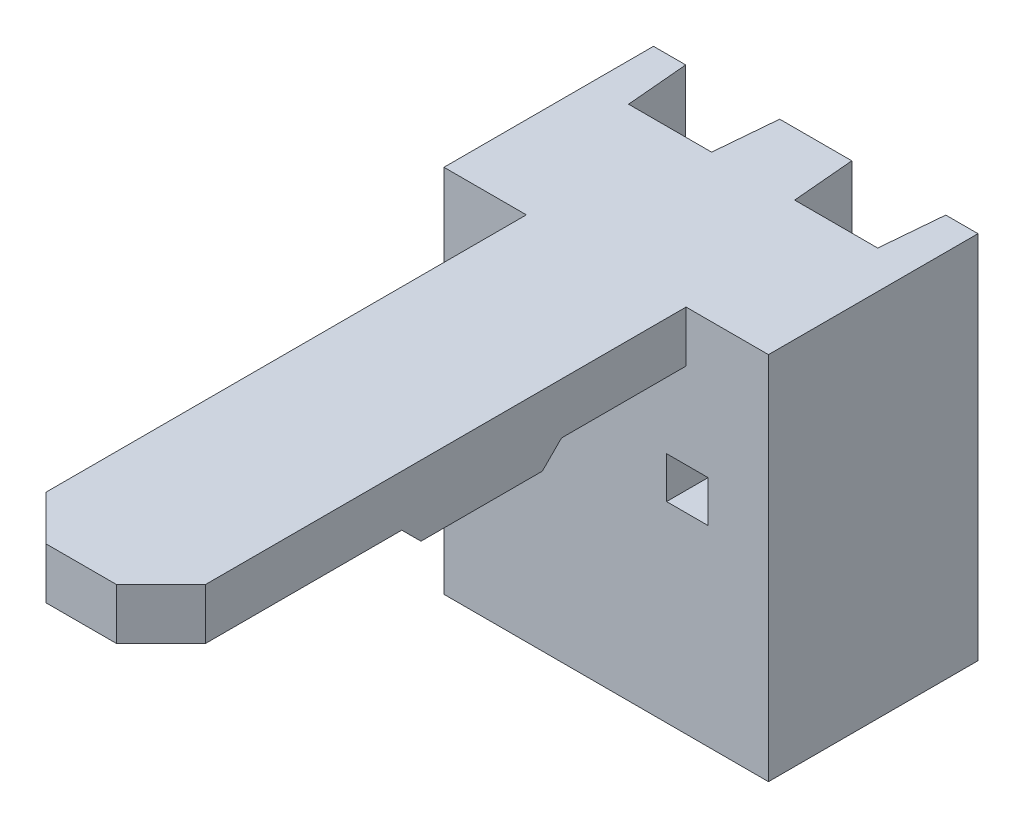
ISO-10303-21;
HEADER;
FILE_DESCRIPTION(('STEP AP214'),'2;1');
FILE_NAME('part.step','',(''),(''),'','','');
FILE_SCHEMA(('AUTOMOTIVE_DESIGN { 1 0 10303 214 1 1 1 1 }'));
ENDSEC;
DATA;
#1=APPLICATION_CONTEXT('core data for automotive mechanical design processes');
#2=APPLICATION_PROTOCOL_DEFINITION('international standard','automotive_design',2000,#1);
#3=PRODUCT_CONTEXT('',#1,'mechanical');
#4=PRODUCT('Part','Part','',(#3));
#5=PRODUCT_RELATED_PRODUCT_CATEGORY('part','',(#4));
#6=PRODUCT_DEFINITION_FORMATION('','',#4);
#7=PRODUCT_DEFINITION_CONTEXT('part definition',#1,'design');
#8=PRODUCT_DEFINITION('design','',#6,#7);
#9=PRODUCT_DEFINITION_SHAPE('','',#8);
#10=(LENGTH_UNIT() NAMED_UNIT(*) SI_UNIT(.MILLI.,.METRE.));
#11=(NAMED_UNIT(*) PLANE_ANGLE_UNIT() SI_UNIT($,.RADIAN.));
#12=(NAMED_UNIT(*) SI_UNIT($,.STERADIAN.) SOLID_ANGLE_UNIT());
#13=UNCERTAINTY_MEASURE_WITH_UNIT(LENGTH_MEASURE(1.E-05),#10,'distance_accuracy_value','');
#14=(GEOMETRIC_REPRESENTATION_CONTEXT(3) GLOBAL_UNCERTAINTY_ASSIGNED_CONTEXT((#13)) GLOBAL_UNIT_ASSIGNED_CONTEXT((#10,
#11,#12)) REPRESENTATION_CONTEXT('',''));
#15=CARTESIAN_POINT('',(0.,0.,0.));
#16=DIRECTION('',(0.,0.,1.));
#17=DIRECTION('',(1.,0.,0.));
#18=AXIS2_PLACEMENT_3D('',#15,#16,#17);
#19=CARTESIAN_POINT('',(0.,0.,-3.28));
#20=DIRECTION('',(0.,0.,1.));
#21=DIRECTION('',(1.,0.,0.));
#22=AXIS2_PLACEMENT_3D('',#19,#20,#21);
#23=PLANE('',#22);
#24=DIRECTION('',(1.,0.,0.));
#25=VECTOR('',#24,1.);
#26=CARTESIAN_POINT('',(0.,-2.895,-3.28));
#27=LINE('',#26,#25);
#28=CARTESIAN_POINT('',(-0.564261109744597,-2.895,-3.28));
#29=VERTEX_POINT('',#28);
#30=CARTESIAN_POINT('',(0.564261109744597,-2.895,-3.28));
#31=VERTEX_POINT('',#30);
#32=EDGE_CURVE('E225',#29,#31,#27,.T.);
#33=ORIENTED_EDGE('',*,*,#32,.F.);
#34=DIRECTION('',(0.,1.,0.));
#35=VECTOR('',#34,1.);
#36=CARTESIAN_POINT('',(-0.564261109744589,3.061095129369,-3.28));
#37=LINE('',#36,#35);
#38=CARTESIAN_POINT('',(-0.564261109744597,2.895,-3.28));
#39=VERTEX_POINT('',#38);
#40=EDGE_CURVE('E227',#29,#39,#37,.T.);
#41=ORIENTED_EDGE('',*,*,#40,.T.);
#42=DIRECTION('',(1.,0.,0.));
#43=VECTOR('',#42,1.);
#44=CARTESIAN_POINT('',(0.,2.895,-3.28));
#45=LINE('',#44,#43);
#46=CARTESIAN_POINT('',(0.564261109744597,2.895,-3.28));
#47=VERTEX_POINT('',#46);
#48=EDGE_CURVE('E20',#47,#39,#45,.F.);
#49=ORIENTED_EDGE('',*,*,#48,.F.);
#50=DIRECTION('',(0.,1.,0.));
#51=VECTOR('',#50,1.);
#52=CARTESIAN_POINT('',(0.564261109744589,3.061095129369,-3.28));
#53=LINE('',#52,#51);
#54=EDGE_CURVE('E246',#47,#31,#53,.F.);
#55=ORIENTED_EDGE('',*,*,#54,.T.);
#56=EDGE_LOOP('',(#33,#41,#49,#55));
#57=FACE_BOUND('',#56,.T.);
#58=ADVANCED_FACE('F17',(#57),#23,.F.);
#59=CARTESIAN_POINT('',(-0.65,3.061095129369,-2.3));
#60=DIRECTION('',(0.996194698091745,0.,0.087155742747664));
#61=DIRECTION('',(0.087155742747664,0.,-0.996194698091745));
#62=AXIS2_PLACEMENT_3D('',#59,#60,#61);
#63=PLANE('',#62);
#64=DIRECTION('',(0.087155742747664,0.,-0.996194698091745));
#65=VECTOR('',#64,1.);
#66=CARTESIAN_POINT('',(-0.65,-2.895,-2.3));
#67=LINE('',#66,#65);
#68=CARTESIAN_POINT('',(-0.65,-2.895,-2.3));
#69=VERTEX_POINT('',#68);
#70=EDGE_CURVE('E210',#69,#29,#67,.T.);
#71=ORIENTED_EDGE('',*,*,#70,.F.);
#72=DIRECTION('',(0.,1.,0.));
#73=VECTOR('',#72,1.);
#74=CARTESIAN_POINT('',(-0.65,-2.895,-2.3));
#75=LINE('',#74,#73);
#76=CARTESIAN_POINT('',(-0.65,2.895,-2.3));
#77=VERTEX_POINT('',#76);
#78=EDGE_CURVE('E233',#69,#77,#75,.T.);
#79=ORIENTED_EDGE('',*,*,#78,.T.);
#80=DIRECTION('',(0.087155742747664,0.,-0.996194698091745));
#81=VECTOR('',#80,1.);
#82=CARTESIAN_POINT('',(-0.65,2.895,-2.3));
#83=LINE('',#82,#81);
#84=EDGE_CURVE('E218',#39,#77,#83,.F.);
#85=ORIENTED_EDGE('',*,*,#84,.F.);
#86=ORIENTED_EDGE('',*,*,#40,.F.);
#87=EDGE_LOOP('',(#71,#79,#85,#86));
#88=FACE_BOUND('',#87,.T.);
#89=ADVANCED_FACE('F231',(#88),#63,.F.);
#90=CARTESIAN_POINT('',(-1.595,0.755,0.));
#91=DIRECTION('',(-1.,0.,0.));
#92=DIRECTION('',(0.,0.,1.));
#93=AXIS2_PLACEMENT_3D('',#90,#91,#92);
#94=PLANE('',#93);
#95=DIRECTION('',(0.,0.,-1.));
#96=VECTOR('',#95,1.);
#97=CARTESIAN_POINT('',(-1.595,0.105,0.));
#98=LINE('',#97,#96);
#99=CARTESIAN_POINT('',(-1.595,0.105,0.));
#100=VERTEX_POINT('',#99);
#101=CARTESIAN_POINT('',(-1.595,0.105,-2.3));
#102=VERTEX_POINT('',#101);
#103=EDGE_CURVE('E248',#100,#102,#98,.T.);
#104=ORIENTED_EDGE('',*,*,#103,.T.);
#105=DIRECTION('',(0.,1.,0.));
#106=VECTOR('',#105,1.);
#107=CARTESIAN_POINT('',(-1.595,-2.895,-2.3));
#108=LINE('',#107,#106);
#109=CARTESIAN_POINT('',(-1.595,0.755,-2.3));
#110=VERTEX_POINT('',#109);
#111=EDGE_CURVE('E258',#102,#110,#108,.T.);
#112=ORIENTED_EDGE('',*,*,#111,.T.);
#113=DIRECTION('',(0.,0.,1.));
#114=VECTOR('',#113,1.);
#115=CARTESIAN_POINT('',(-1.595,0.755,0.));
#116=LINE('',#115,#114);
#117=CARTESIAN_POINT('',(-1.595,0.755,0.));
#118=VERTEX_POINT('',#117);
#119=EDGE_CURVE('E266',#110,#118,#116,.T.);
#120=ORIENTED_EDGE('',*,*,#119,.T.);
#121=DIRECTION('',(0.,1.,0.));
#122=VECTOR('',#121,1.);
#123=CARTESIAN_POINT('',(-1.595,0.755,0.));
#124=LINE('',#123,#122);
#125=EDGE_CURVE('E229',#100,#118,#124,.T.);
#126=ORIENTED_EDGE('',*,*,#125,.F.);
#127=EDGE_LOOP('',(#104,#112,#120,#126));
#128=FACE_BOUND('',#127,.T.);
#129=ADVANCED_FACE('F490',(#128),#94,.F.);
#130=CARTESIAN_POINT('',(0.945,0.755,0.));
#131=DIRECTION('',(-1.,0.,0.));
#132=DIRECTION('',(0.,0.,1.));
#133=AXIS2_PLACEMENT_3D('',#130,#131,#132);
#134=PLANE('',#133);
#135=DIRECTION('',(0.,0.,-1.));
#136=VECTOR('',#135,1.);
#137=CARTESIAN_POINT('',(0.945,0.105,0.));
#138=LINE('',#137,#136);
#139=CARTESIAN_POINT('',(0.945,0.105,0.));
#140=VERTEX_POINT('',#139);
#141=CARTESIAN_POINT('',(0.945,0.105,-2.3));
#142=VERTEX_POINT('',#141);
#143=EDGE_CURVE('E271',#140,#142,#138,.T.);
#144=ORIENTED_EDGE('',*,*,#143,.T.);
#145=DIRECTION('',(0.,1.,0.));
#146=VECTOR('',#145,1.);
#147=CARTESIAN_POINT('',(0.945,0.755,-2.3));
#148=LINE('',#147,#146);
#149=CARTESIAN_POINT('',(0.945,0.755,-2.3));
#150=VERTEX_POINT('',#149);
#151=EDGE_CURVE('E239',#150,#142,#148,.F.);
#152=ORIENTED_EDGE('',*,*,#151,.F.);
#153=DIRECTION('',(0.,0.,1.));
#154=VECTOR('',#153,1.);
#155=CARTESIAN_POINT('',(0.945,0.755,0.));
#156=LINE('',#155,#154);
#157=CARTESIAN_POINT('',(0.945,0.755,0.));
#158=VERTEX_POINT('',#157);
#159=EDGE_CURVE('E277',#150,#158,#156,.T.);
#160=ORIENTED_EDGE('',*,*,#159,.T.);
#161=DIRECTION('',(0.,1.,0.));
#162=VECTOR('',#161,1.);
#163=CARTESIAN_POINT('',(0.945,0.755,0.));
#164=LINE('',#163,#162);
#165=EDGE_CURVE('E241',#140,#158,#164,.T.);
#166=ORIENTED_EDGE('',*,*,#165,.F.);
#167=EDGE_LOOP('',(#144,#152,#160,#166));
#168=FACE_BOUND('',#167,.T.);
#169=ADVANCED_FACE('F480',(#168),#134,.F.);
#170=CARTESIAN_POINT('',(0.65,3.061095129369,-2.3));
#171=DIRECTION('',(-0.996194698091745,0.,0.087155742747664));
#172=DIRECTION('',(0.087155742747664,0.,0.996194698091745));
#173=AXIS2_PLACEMENT_3D('',#170,#171,#172);
#174=PLANE('',#173);
#175=DIRECTION('',(0.087155742747664,0.,0.996194698091745));
#176=VECTOR('',#175,1.);
#177=CARTESIAN_POINT('',(0.65,2.895,-2.3));
#178=LINE('',#177,#176);
#179=CARTESIAN_POINT('',(0.65,2.895,-2.3));
#180=VERTEX_POINT('',#179);
#181=EDGE_CURVE('E221',#180,#47,#178,.F.);
#182=ORIENTED_EDGE('',*,*,#181,.F.);
#183=DIRECTION('',(0.,1.,0.));
#184=VECTOR('',#183,1.);
#185=CARTESIAN_POINT('',(0.65,-2.895,-2.3));
#186=LINE('',#185,#184);
#187=CARTESIAN_POINT('',(0.65,-2.895,-2.3));
#188=VERTEX_POINT('',#187);
#189=EDGE_CURVE('E284',#180,#188,#186,.F.);
#190=ORIENTED_EDGE('',*,*,#189,.T.);
#191=DIRECTION('',(0.087155742747664,0.,0.996194698091745));
#192=VECTOR('',#191,1.);
#193=CARTESIAN_POINT('',(0.65,-2.895,-2.3));
#194=LINE('',#193,#192);
#195=EDGE_CURVE('E243',#31,#188,#194,.T.);
#196=ORIENTED_EDGE('',*,*,#195,.F.);
#197=ORIENTED_EDGE('',*,*,#54,.F.);
#198=EDGE_LOOP('',(#182,#190,#196,#197));
#199=FACE_BOUND('',#198,.T.);
#200=ADVANCED_FACE('F477',(#199),#174,.F.);
#201=CARTESIAN_POINT('',(-1.595,0.105,0.));
#202=DIRECTION('',(0.,-1.,0.));
#203=DIRECTION('',(0.,0.,-1.));
#204=AXIS2_PLACEMENT_3D('',#201,#202,#203);
#205=PLANE('',#204);
#206=DIRECTION('',(0.,0.,-1.));
#207=VECTOR('',#206,1.);
#208=CARTESIAN_POINT('',(-0.945,0.105,0.));
#209=LINE('',#208,#207);
#210=CARTESIAN_POINT('',(-0.945,0.105,0.));
#211=VERTEX_POINT('',#210);
#212=CARTESIAN_POINT('',(-0.945,0.105,-2.3));
#213=VERTEX_POINT('',#212);
#214=EDGE_CURVE('E309',#211,#213,#209,.T.);
#215=ORIENTED_EDGE('',*,*,#214,.T.);
#216=DIRECTION('',(1.,0.,0.));
#217=VECTOR('',#216,1.);
#218=CARTESIAN_POINT('',(-0.65,0.105,-2.3));
#219=LINE('',#218,#217);
#220=EDGE_CURVE('E260',#213,#102,#219,.F.);
#221=ORIENTED_EDGE('',*,*,#220,.T.);
#222=ORIENTED_EDGE('',*,*,#103,.F.);
#223=DIRECTION('',(1.,0.,0.));
#224=VECTOR('',#223,1.);
#225=CARTESIAN_POINT('',(-1.595,0.105,0.));
#226=LINE('',#225,#224);
#227=EDGE_CURVE('E250',#211,#100,#226,.F.);
#228=ORIENTED_EDGE('',*,*,#227,.F.);
#229=EDGE_LOOP('',(#215,#221,#222,#228));
#230=FACE_BOUND('',#229,.T.);
#231=ADVANCED_FACE('F479',(#230),#205,.F.);
#232=CARTESIAN_POINT('',(-0.65,-2.895,-2.3));
#233=DIRECTION('',(0.,0.,1.));
#234=DIRECTION('',(1.,0.,0.));
#235=AXIS2_PLACEMENT_3D('',#232,#233,#234);
#236=PLANE('',#235);
#237=DIRECTION('',(0.,1.,0.));
#238=VECTOR('',#237,1.);
#239=CARTESIAN_POINT('',(-0.945,0.105,-2.3));
#240=LINE('',#239,#238);
#241=CARTESIAN_POINT('',(-0.945,0.755,-2.3));
#242=VERTEX_POINT('',#241);
#243=EDGE_CURVE('E311',#213,#242,#240,.T.);
#244=ORIENTED_EDGE('',*,*,#243,.T.);
#245=DIRECTION('',(1.,0.,0.));
#246=VECTOR('',#245,1.);
#247=CARTESIAN_POINT('',(-0.945,0.755,-2.3));
#248=LINE('',#247,#246);
#249=EDGE_CURVE('E263',#242,#110,#248,.F.);
#250=ORIENTED_EDGE('',*,*,#249,.T.);
#251=ORIENTED_EDGE('',*,*,#111,.F.);
#252=ORIENTED_EDGE('',*,*,#220,.F.);
#253=EDGE_LOOP('',(#244,#250,#251,#252));
#254=FACE_BOUND('',#253,.T.);
#255=DIRECTION('',(0.,1.,0.));
#256=VECTOR('',#255,1.);
#257=CARTESIAN_POINT('',(-1.95,3.061095129369,-2.3));
#258=LINE('',#257,#256);
#259=CARTESIAN_POINT('',(-1.95,-2.895,-2.3));
#260=VERTEX_POINT('',#259);
#261=CARTESIAN_POINT('',(-1.95,2.895,-2.3));
#262=VERTEX_POINT('',#261);
#263=EDGE_CURVE('E296',#260,#262,#258,.T.);
#264=ORIENTED_EDGE('',*,*,#263,.T.);
#265=DIRECTION('',(1.,0.,0.));
#266=VECTOR('',#265,1.);
#267=CARTESIAN_POINT('',(-0.65,2.895,-2.3));
#268=LINE('',#267,#266);
#269=EDGE_CURVE('E254',#77,#262,#268,.F.);
#270=ORIENTED_EDGE('',*,*,#269,.F.);
#271=ORIENTED_EDGE('',*,*,#78,.F.);
#272=DIRECTION('',(1.,0.,0.));
#273=VECTOR('',#272,1.);
#274=CARTESIAN_POINT('',(-0.65,-2.895,-2.3));
#275=LINE('',#274,#273);
#276=EDGE_CURVE('E256',#260,#69,#275,.T.);
#277=ORIENTED_EDGE('',*,*,#276,.F.);
#278=EDGE_LOOP('',(#264,#270,#271,#277));
#279=FACE_BOUND('',#278,.T.);
#280=ADVANCED_FACE('F487',(#254,#279),#236,.F.);
#281=CARTESIAN_POINT('',(-0.945,0.755,0.));
#282=DIRECTION('',(0.,1.,0.));
#283=DIRECTION('',(0.,0.,1.));
#284=AXIS2_PLACEMENT_3D('',#281,#282,#283);
#285=PLANE('',#284);
#286=ORIENTED_EDGE('',*,*,#119,.F.);
#287=ORIENTED_EDGE('',*,*,#249,.F.);
#288=DIRECTION('',(0.,0.,-1.));
#289=VECTOR('',#288,1.);
#290=CARTESIAN_POINT('',(-0.945,0.755,0.));
#291=LINE('',#290,#289);
#292=CARTESIAN_POINT('',(-0.945,0.755,0.));
#293=VERTEX_POINT('',#292);
#294=EDGE_CURVE('E313',#242,#293,#291,.F.);
#295=ORIENTED_EDGE('',*,*,#294,.T.);
#296=DIRECTION('',(1.,0.,0.));
#297=VECTOR('',#296,1.);
#298=CARTESIAN_POINT('',(-0.945,0.755,0.));
#299=LINE('',#298,#297);
#300=EDGE_CURVE('E269',#118,#293,#299,.T.);
#301=ORIENTED_EDGE('',*,*,#300,.F.);
#302=EDGE_LOOP('',(#286,#287,#295,#301));
#303=FACE_BOUND('',#302,.T.);
#304=ADVANCED_FACE('F577',(#303),#285,.F.);
#305=CARTESIAN_POINT('',(0.945,0.105,0.));
#306=DIRECTION('',(0.,-1.,0.));
#307=DIRECTION('',(0.,0.,-1.));
#308=AXIS2_PLACEMENT_3D('',#305,#306,#307);
#309=PLANE('',#308);
#310=DIRECTION('',(0.,0.,-1.));
#311=VECTOR('',#310,1.);
#312=CARTESIAN_POINT('',(1.595,0.105,0.));
#313=LINE('',#312,#311);
#314=CARTESIAN_POINT('',(1.595,0.105,0.));
#315=VERTEX_POINT('',#314);
#316=CARTESIAN_POINT('',(1.595,0.105,-2.3));
#317=VERTEX_POINT('',#316);
#318=EDGE_CURVE('E316',#315,#317,#313,.T.);
#319=ORIENTED_EDGE('',*,*,#318,.T.);
#320=DIRECTION('',(1.,0.,0.));
#321=VECTOR('',#320,1.);
#322=CARTESIAN_POINT('',(1.95,0.105,-2.3));
#323=LINE('',#322,#321);
#324=EDGE_CURVE('E291',#317,#142,#323,.F.);
#325=ORIENTED_EDGE('',*,*,#324,.T.);
#326=ORIENTED_EDGE('',*,*,#143,.F.);
#327=DIRECTION('',(1.,0.,0.));
#328=VECTOR('',#327,1.);
#329=CARTESIAN_POINT('',(0.945,0.105,0.));
#330=LINE('',#329,#328);
#331=EDGE_CURVE('E274',#315,#140,#330,.F.);
#332=ORIENTED_EDGE('',*,*,#331,.F.);
#333=EDGE_LOOP('',(#319,#325,#326,#332));
#334=FACE_BOUND('',#333,.T.);
#335=ADVANCED_FACE('F573',(#334),#309,.F.);
#336=CARTESIAN_POINT('',(1.595,0.755,0.));
#337=DIRECTION('',(0.,1.,0.));
#338=DIRECTION('',(0.,0.,1.));
#339=AXIS2_PLACEMENT_3D('',#336,#337,#338);
#340=PLANE('',#339);
#341=ORIENTED_EDGE('',*,*,#159,.F.);
#342=DIRECTION('',(1.,0.,0.));
#343=VECTOR('',#342,1.);
#344=CARTESIAN_POINT('',(1.95,0.755,-2.3));
#345=LINE('',#344,#343);
#346=CARTESIAN_POINT('',(1.595,0.755,-2.3));
#347=VERTEX_POINT('',#346);
#348=EDGE_CURVE('E289',#150,#347,#345,.T.);
#349=ORIENTED_EDGE('',*,*,#348,.T.);
#350=DIRECTION('',(0.,0.,-1.));
#351=VECTOR('',#350,1.);
#352=CARTESIAN_POINT('',(1.595,0.755,0.));
#353=LINE('',#352,#351);
#354=CARTESIAN_POINT('',(1.595,0.755,0.));
#355=VERTEX_POINT('',#354);
#356=EDGE_CURVE('E321',#347,#355,#353,.F.);
#357=ORIENTED_EDGE('',*,*,#356,.T.);
#358=DIRECTION('',(1.,0.,0.));
#359=VECTOR('',#358,1.);
#360=CARTESIAN_POINT('',(1.595,0.755,0.));
#361=LINE('',#360,#359);
#362=EDGE_CURVE('E280',#158,#355,#361,.T.);
#363=ORIENTED_EDGE('',*,*,#362,.F.);
#364=EDGE_LOOP('',(#341,#349,#357,#363));
#365=FACE_BOUND('',#364,.T.);
#366=ADVANCED_FACE('F569',(#365),#340,.F.);
#367=CARTESIAN_POINT('',(1.95,-2.895,-2.3));
#368=DIRECTION('',(0.,0.,1.));
#369=DIRECTION('',(1.,0.,0.));
#370=AXIS2_PLACEMENT_3D('',#367,#368,#369);
#371=PLANE('',#370);
#372=DIRECTION('',(0.,1.,0.));
#373=VECTOR('',#372,1.);
#374=CARTESIAN_POINT('',(1.595,0.105,-2.3));
#375=LINE('',#374,#373);
#376=EDGE_CURVE('E318',#317,#347,#375,.T.);
#377=ORIENTED_EDGE('',*,*,#376,.T.);
#378=ORIENTED_EDGE('',*,*,#348,.F.);
#379=ORIENTED_EDGE('',*,*,#151,.T.);
#380=ORIENTED_EDGE('',*,*,#324,.F.);
#381=EDGE_LOOP('',(#377,#378,#379,#380));
#382=FACE_BOUND('',#381,.T.);
#383=ORIENTED_EDGE('',*,*,#189,.F.);
#384=DIRECTION('',(1.,0.,0.));
#385=VECTOR('',#384,1.);
#386=CARTESIAN_POINT('',(1.95,2.895,-2.3));
#387=LINE('',#386,#385);
#388=CARTESIAN_POINT('',(1.95,2.895,-2.3));
#389=VERTEX_POINT('',#388);
#390=EDGE_CURVE('E282',#389,#180,#387,.F.);
#391=ORIENTED_EDGE('',*,*,#390,.F.);
#392=DIRECTION('',(0.,1.,0.));
#393=VECTOR('',#392,1.);
#394=CARTESIAN_POINT('',(1.95,3.061095129369,-2.3));
#395=LINE('',#394,#393);
#396=CARTESIAN_POINT('',(1.95,-2.895,-2.3));
#397=VERTEX_POINT('',#396);
#398=EDGE_CURVE('E326',#389,#397,#395,.F.);
#399=ORIENTED_EDGE('',*,*,#398,.T.);
#400=DIRECTION('',(1.,0.,0.));
#401=VECTOR('',#400,1.);
#402=CARTESIAN_POINT('',(1.95,-2.895,-2.3));
#403=LINE('',#402,#401);
#404=EDGE_CURVE('E287',#188,#397,#403,.T.);
#405=ORIENTED_EDGE('',*,*,#404,.F.);
#406=EDGE_LOOP('',(#383,#391,#399,#405));
#407=FACE_BOUND('',#406,.T.);
#408=ADVANCED_FACE('F475',(#382,#407),#371,.F.);
#409=CARTESIAN_POINT('',(-1.95,3.061095129369,-2.3));
#410=DIRECTION('',(-0.996194698091745,0.,0.087155742747664));
#411=DIRECTION('',(0.087155742747664,0.,0.996194698091745));
#412=AXIS2_PLACEMENT_3D('',#409,#410,#411);
#413=PLANE('',#412);
#414=DIRECTION('',(0.087155742747664,0.,0.996194698091745));
#415=VECTOR('',#414,1.);
#416=CARTESIAN_POINT('',(-1.95,2.895,-2.3));
#417=LINE('',#416,#415);
#418=CARTESIAN_POINT('',(-2.0357388902551,2.895,-3.27999999999999));
#419=VERTEX_POINT('',#418);
#420=EDGE_CURVE('E299',#262,#419,#417,.F.);
#421=ORIENTED_EDGE('',*,*,#420,.F.);
#422=ORIENTED_EDGE('',*,*,#263,.F.);
#423=DIRECTION('',(0.087155742747664,0.,0.996194698091745));
#424=VECTOR('',#423,1.);
#425=CARTESIAN_POINT('',(-1.95,-2.895,-2.3));
#426=LINE('',#425,#424);
#427=CARTESIAN_POINT('',(-2.0357388902552,-2.895,-3.27999999999998));
#428=VERTEX_POINT('',#427);
#429=EDGE_CURVE('E294',#428,#260,#426,.T.);
#430=ORIENTED_EDGE('',*,*,#429,.F.);
#431=DIRECTION('',(0.,1.,0.));
#432=VECTOR('',#431,1.);
#433=CARTESIAN_POINT('',(-2.035738890255,0.,-3.28));
#434=LINE('',#433,#432);
#435=EDGE_CURVE('E331',#428,#419,#434,.T.);
#436=ORIENTED_EDGE('',*,*,#435,.T.);
#437=EDGE_LOOP('',(#421,#422,#430,#436));
#438=FACE_BOUND('',#437,.T.);
#439=ADVANCED_FACE('F562',(#438),#413,.F.);
#440=CARTESIAN_POINT('',(0.,1.945,2.1));
#441=DIRECTION('',(0.,-0.707106781186548,-0.707106781186548));
#442=DIRECTION('',(0.,0.707106781186548,-0.707106781186548));
#443=AXIS2_PLACEMENT_3D('',#440,#441,#442);
#444=PLANE('',#443);
#445=DIRECTION('',(0.,0.707106781186548,-0.707106781186548));
#446=VECTOR('',#445,1.);
#447=CARTESIAN_POINT('',(-1.25,1.945,2.1));
#448=LINE('',#447,#446);
#449=CARTESIAN_POINT('',(-1.25,1.795,2.25));
#450=VERTEX_POINT('',#449);
#451=CARTESIAN_POINT('',(-1.25,2.095,1.95));
#452=VERTEX_POINT('',#451);
#453=EDGE_CURVE('E303',#450,#452,#448,.T.);
#454=ORIENTED_EDGE('',*,*,#453,.T.);
#455=DIRECTION('',(1.,0.,0.));
#456=VECTOR('',#455,1.);
#457=CARTESIAN_POINT('',(-1.25,2.095,1.95));
#458=LINE('',#457,#456);
#459=CARTESIAN_POINT('',(1.25,2.095,1.95));
#460=VERTEX_POINT('',#459);
#461=EDGE_CURVE('E340',#460,#452,#458,.F.);
#462=ORIENTED_EDGE('',*,*,#461,.F.);
#463=DIRECTION('',(0.,0.707106781186548,-0.707106781186548));
#464=VECTOR('',#463,1.);
#465=CARTESIAN_POINT('',(1.25,1.945,2.1));
#466=LINE('',#465,#464);
#467=CARTESIAN_POINT('',(1.25,1.795,2.25));
#468=VERTEX_POINT('',#467);
#469=EDGE_CURVE('E301',#460,#468,#466,.F.);
#470=ORIENTED_EDGE('',*,*,#469,.T.);
#471=DIRECTION('',(1.,0.,0.));
#472=VECTOR('',#471,1.);
#473=CARTESIAN_POINT('',(0.,1.795,2.25));
#474=LINE('',#473,#472);
#475=EDGE_CURVE('E337',#450,#468,#474,.T.);
#476=ORIENTED_EDGE('',*,*,#475,.F.);
#477=EDGE_LOOP('',(#454,#462,#470,#476));
#478=FACE_BOUND('',#477,.T.);
#479=ADVANCED_FACE('F558',(#478),#444,.T.);
#480=CARTESIAN_POINT('',(0.,1.945,4.3));
#481=DIRECTION('',(0.,-0.707106781186548,0.707106781186548));
#482=DIRECTION('',(0.,-0.707106781186548,-0.707106781186548));
#483=AXIS2_PLACEMENT_3D('',#480,#481,#482);
#484=PLANE('',#483);
#485=DIRECTION('',(0.,-0.707106781186548,-0.707106781186548));
#486=VECTOR('',#485,1.);
#487=CARTESIAN_POINT('',(1.25,1.945,4.3));
#488=LINE('',#487,#486);
#489=CARTESIAN_POINT('',(1.25,1.795,4.15));
#490=VERTEX_POINT('',#489);
#491=CARTESIAN_POINT('',(1.25,2.095,4.45));
#492=VERTEX_POINT('',#491);
#493=EDGE_CURVE('E307',#490,#492,#488,.F.);
#494=ORIENTED_EDGE('',*,*,#493,.T.);
#495=DIRECTION('',(1.,0.,0.));
#496=VECTOR('',#495,1.);
#497=CARTESIAN_POINT('',(-1.25,2.095,4.45));
#498=LINE('',#497,#496);
#499=CARTESIAN_POINT('',(-1.25,2.095,4.45));
#500=VERTEX_POINT('',#499);
#501=EDGE_CURVE('E343',#500,#492,#498,.T.);
#502=ORIENTED_EDGE('',*,*,#501,.F.);
#503=DIRECTION('',(0.,-0.707106781186548,-0.707106781186548));
#504=VECTOR('',#503,1.);
#505=CARTESIAN_POINT('',(-1.25,1.945,4.3));
#506=LINE('',#505,#504);
#507=CARTESIAN_POINT('',(-1.25,1.795,4.15));
#508=VERTEX_POINT('',#507);
#509=EDGE_CURVE('E305',#500,#508,#506,.T.);
#510=ORIENTED_EDGE('',*,*,#509,.T.);
#511=DIRECTION('',(1.,0.,0.));
#512=VECTOR('',#511,1.);
#513=CARTESIAN_POINT('',(0.,1.795,4.15));
#514=LINE('',#513,#512);
#515=EDGE_CURVE('E334',#490,#508,#514,.F.);
#516=ORIENTED_EDGE('',*,*,#515,.F.);
#517=EDGE_LOOP('',(#494,#502,#510,#516));
#518=FACE_BOUND('',#517,.T.);
#519=ADVANCED_FACE('F554',(#518),#484,.T.);
#520=CARTESIAN_POINT('',(-0.945,0.105,0.));
#521=DIRECTION('',(1.,0.,0.));
#522=DIRECTION('',(0.,0.,-1.));
#523=AXIS2_PLACEMENT_3D('',#520,#521,#522);
#524=PLANE('',#523);
#525=ORIENTED_EDGE('',*,*,#294,.F.);
#526=ORIENTED_EDGE('',*,*,#243,.F.);
#527=ORIENTED_EDGE('',*,*,#214,.F.);
#528=DIRECTION('',(0.,1.,0.));
#529=VECTOR('',#528,1.);
#530=CARTESIAN_POINT('',(-0.945,0.,0.));
#531=LINE('',#530,#529);
#532=EDGE_CURVE('E352',#293,#211,#531,.F.);
#533=ORIENTED_EDGE('',*,*,#532,.F.);
#534=EDGE_LOOP('',(#525,#526,#527,#533));
#535=FACE_BOUND('',#534,.T.);
#536=ADVANCED_FACE('F550',(#535),#524,.F.);
#537=CARTESIAN_POINT('',(1.595,0.105,0.));
#538=DIRECTION('',(1.,0.,0.));
#539=DIRECTION('',(0.,0.,-1.));
#540=AXIS2_PLACEMENT_3D('',#537,#538,#539);
#541=PLANE('',#540);
#542=ORIENTED_EDGE('',*,*,#356,.F.);
#543=ORIENTED_EDGE('',*,*,#376,.F.);
#544=ORIENTED_EDGE('',*,*,#318,.F.);
#545=DIRECTION('',(0.,1.,0.));
#546=VECTOR('',#545,1.);
#547=CARTESIAN_POINT('',(1.595,0.,0.));
#548=LINE('',#547,#546);
#549=EDGE_CURVE('E355',#355,#315,#548,.F.);
#550=ORIENTED_EDGE('',*,*,#549,.F.);
#551=EDGE_LOOP('',(#542,#543,#544,#550));
#552=FACE_BOUND('',#551,.T.);
#553=ADVANCED_FACE('F547',(#552),#541,.F.);
#554=CARTESIAN_POINT('',(1.95,3.061095129369,-2.3));
#555=DIRECTION('',(0.996194698091745,0.,0.087155742747664));
#556=DIRECTION('',(0.087155742747664,0.,-0.996194698091745));
#557=AXIS2_PLACEMENT_3D('',#554,#555,#556);
#558=PLANE('',#557);
#559=DIRECTION('',(0.0871557427472491,0.,-0.996194698091781));
#560=VECTOR('',#559,1.);
#561=CARTESIAN_POINT('',(1.95,-2.895,-2.3));
#562=LINE('',#561,#560);
#563=CARTESIAN_POINT('',(2.0357388902551,-2.895,-3.27999999999999));
#564=VERTEX_POINT('',#563);
#565=EDGE_CURVE('E358',#397,#564,#562,.T.);
#566=ORIENTED_EDGE('',*,*,#565,.F.);
#567=ORIENTED_EDGE('',*,*,#398,.F.);
#568=DIRECTION('',(0.087155742747664,0.,-0.996194698091745));
#569=VECTOR('',#568,1.);
#570=CARTESIAN_POINT('',(1.95,2.895,-2.3));
#571=LINE('',#570,#569);
#572=CARTESIAN_POINT('',(2.0357388902551,2.895,-3.27999999999999));
#573=VERTEX_POINT('',#572);
#574=EDGE_CURVE('E324',#573,#389,#571,.F.);
#575=ORIENTED_EDGE('',*,*,#574,.F.);
#576=DIRECTION('',(0.,1.,0.));
#577=VECTOR('',#576,1.);
#578=CARTESIAN_POINT('',(2.035738890255,0.,-3.28));
#579=LINE('',#578,#577);
#580=EDGE_CURVE('E369',#573,#564,#579,.F.);
#581=ORIENTED_EDGE('',*,*,#580,.T.);
#582=EDGE_LOOP('',(#566,#567,#575,#581));
#583=FACE_BOUND('',#582,.T.);
#584=ADVANCED_FACE('F467',(#583),#558,.F.);
#585=CARTESIAN_POINT('',(0.,0.,-3.28));
#586=DIRECTION('',(0.,0.,1.));
#587=DIRECTION('',(1.,0.,0.));
#588=AXIS2_PLACEMENT_3D('',#585,#586,#587);
#589=PLANE('',#588);
#590=DIRECTION('',(1.,0.,0.));
#591=VECTOR('',#590,1.);
#592=CARTESIAN_POINT('',(-2.54,-2.895,-3.28));
#593=LINE('',#592,#591);
#594=CARTESIAN_POINT('',(-2.54,-2.895,-3.28));
#595=VERTEX_POINT('',#594);
#596=EDGE_CURVE('E363',#595,#428,#593,.T.);
#597=ORIENTED_EDGE('',*,*,#596,.F.);
#598=DIRECTION('',(0.,1.,0.));
#599=VECTOR('',#598,1.);
#600=CARTESIAN_POINT('',(-2.54,2.895,-3.28));
#601=LINE('',#600,#599);
#602=CARTESIAN_POINT('',(-2.54,2.895,-3.28));
#603=VERTEX_POINT('',#602);
#604=EDGE_CURVE('E375',#603,#595,#601,.F.);
#605=ORIENTED_EDGE('',*,*,#604,.F.);
#606=DIRECTION('',(1.,0.,0.));
#607=VECTOR('',#606,1.);
#608=CARTESIAN_POINT('',(0.,2.895,-3.28));
#609=LINE('',#608,#607);
#610=EDGE_CURVE('E329',#419,#603,#609,.F.);
#611=ORIENTED_EDGE('',*,*,#610,.F.);
#612=ORIENTED_EDGE('',*,*,#435,.F.);
#613=EDGE_LOOP('',(#597,#605,#611,#612));
#614=FACE_BOUND('',#613,.T.);
#615=ADVANCED_FACE('F540',(#614),#589,.F.);
#616=CARTESIAN_POINT('',(0.,1.795,8.22));
#617=DIRECTION('',(0.,-1.,0.));
#618=DIRECTION('',(0.,0.,-1.));
#619=AXIS2_PLACEMENT_3D('',#616,#617,#618);
#620=PLANE('',#619);
#621=ORIENTED_EDGE('',*,*,#475,.T.);
#622=DIRECTION('',(0.,0.,-1.));
#623=VECTOR('',#622,1.);
#624=CARTESIAN_POINT('',(1.25,1.795,0.));
#625=LINE('',#624,#623);
#626=EDGE_CURVE('E408',#490,#468,#625,.T.);
#627=ORIENTED_EDGE('',*,*,#626,.F.);
#628=ORIENTED_EDGE('',*,*,#515,.T.);
#629=DIRECTION('',(0.,0.,1.));
#630=VECTOR('',#629,1.);
#631=CARTESIAN_POINT('',(-1.25,1.795,0.));
#632=LINE('',#631,#630);
#633=EDGE_CURVE('E390',#450,#508,#632,.T.);
#634=ORIENTED_EDGE('',*,*,#633,.F.);
#635=EDGE_LOOP('',(#621,#627,#628,#634));
#636=FACE_BOUND('',#635,.T.);
#637=ADVANCED_FACE('F536',(#636),#620,.T.);
#638=CARTESIAN_POINT('',(-1.25,2.095,0.));
#639=DIRECTION('',(0.,-1.,0.));
#640=DIRECTION('',(0.,0.,-1.));
#641=AXIS2_PLACEMENT_3D('',#638,#639,#640);
#642=PLANE('',#641);
#643=DIRECTION('',(1.,0.,0.));
#644=VECTOR('',#643,1.);
#645=CARTESIAN_POINT('',(0.,2.095,0.));
#646=LINE('',#645,#644);
#647=CARTESIAN_POINT('',(1.25,2.095,0.));
#648=VERTEX_POINT('',#647);
#649=CARTESIAN_POINT('',(-1.25,2.095,0.));
#650=VERTEX_POINT('',#649);
#651=EDGE_CURVE('E350',#648,#650,#646,.F.);
#652=ORIENTED_EDGE('',*,*,#651,.F.);
#653=DIRECTION('',(0.,0.,-1.));
#654=VECTOR('',#653,1.);
#655=CARTESIAN_POINT('',(1.25,2.095,0.));
#656=LINE('',#655,#654);
#657=EDGE_CURVE('E411',#460,#648,#656,.T.);
#658=ORIENTED_EDGE('',*,*,#657,.F.);
#659=ORIENTED_EDGE('',*,*,#461,.T.);
#660=DIRECTION('',(0.,0.,1.));
#661=VECTOR('',#660,1.);
#662=CARTESIAN_POINT('',(-1.25,2.095,0.));
#663=LINE('',#662,#661);
#664=EDGE_CURVE('E387',#650,#452,#663,.T.);
#665=ORIENTED_EDGE('',*,*,#664,.F.);
#666=EDGE_LOOP('',(#652,#658,#659,#665));
#667=FACE_BOUND('',#666,.T.);
#668=ADVANCED_FACE('F532',(#667),#642,.T.);
#669=CARTESIAN_POINT('',(-1.25,2.095,0.));
#670=DIRECTION('',(0.,-1.,0.));
#671=DIRECTION('',(0.,0.,-1.));
#672=AXIS2_PLACEMENT_3D('',#669,#670,#671);
#673=PLANE('',#672);
#674=DIRECTION('',(0.707106781186548,0.,0.707106781186548));
#675=VECTOR('',#674,1.);
#676=CARTESIAN_POINT('',(-0.9,2.095,7.87));
#677=LINE('',#676,#675);
#678=CARTESIAN_POINT('',(-1.25,2.095,7.52));
#679=VERTEX_POINT('',#678);
#680=CARTESIAN_POINT('',(-0.55,2.095,8.22));
#681=VERTEX_POINT('',#680);
#682=EDGE_CURVE('E393',#679,#681,#677,.T.);
#683=ORIENTED_EDGE('',*,*,#682,.F.);
#684=DIRECTION('',(0.,0.,1.));
#685=VECTOR('',#684,1.);
#686=CARTESIAN_POINT('',(-1.25,2.095,0.));
#687=LINE('',#686,#685);
#688=EDGE_CURVE('E381',#500,#679,#687,.T.);
#689=ORIENTED_EDGE('',*,*,#688,.F.);
#690=ORIENTED_EDGE('',*,*,#501,.T.);
#691=DIRECTION('',(0.,0.,-1.));
#692=VECTOR('',#691,1.);
#693=CARTESIAN_POINT('',(1.25,2.095,0.));
#694=LINE('',#693,#692);
#695=CARTESIAN_POINT('',(1.25,2.095,7.52));
#696=VERTEX_POINT('',#695);
#697=EDGE_CURVE('E420',#696,#492,#694,.T.);
#698=ORIENTED_EDGE('',*,*,#697,.F.);
#699=DIRECTION('',(0.707106781186548,0.,-0.707106781186548));
#700=VECTOR('',#699,1.);
#701=CARTESIAN_POINT('',(0.9,2.095,7.87));
#702=LINE('',#701,#700);
#703=CARTESIAN_POINT('',(0.55,2.095,8.22));
#704=VERTEX_POINT('',#703);
#705=EDGE_CURVE('E406',#704,#696,#702,.T.);
#706=ORIENTED_EDGE('',*,*,#705,.F.);
#707=DIRECTION('',(1.,0.,0.));
#708=VECTOR('',#707,1.);
#709=CARTESIAN_POINT('',(0.,2.095,8.22));
#710=LINE('',#709,#708);
#711=EDGE_CURVE('E401',#681,#704,#710,.T.);
#712=ORIENTED_EDGE('',*,*,#711,.F.);
#713=EDGE_LOOP('',(#683,#689,#690,#698,#706,#712));
#714=FACE_BOUND('',#713,.T.);
#715=ADVANCED_FACE('F528',(#714),#673,.T.);
#716=CARTESIAN_POINT('',(0.,0.,0.));
#717=DIRECTION('',(0.,0.,1.));
#718=DIRECTION('',(1.,0.,0.));
#719=AXIS2_PLACEMENT_3D('',#716,#717,#718);
#720=PLANE('',#719);
#721=ORIENTED_EDGE('',*,*,#362,.T.);
#722=ORIENTED_EDGE('',*,*,#549,.T.);
#723=ORIENTED_EDGE('',*,*,#331,.T.);
#724=ORIENTED_EDGE('',*,*,#165,.T.);
#725=EDGE_LOOP('',(#721,#722,#723,#724));
#726=FACE_BOUND('',#725,.T.);
#727=ORIENTED_EDGE('',*,*,#300,.T.);
#728=ORIENTED_EDGE('',*,*,#532,.T.);
#729=ORIENTED_EDGE('',*,*,#227,.T.);
#730=ORIENTED_EDGE('',*,*,#125,.T.);
#731=EDGE_LOOP('',(#727,#728,#729,#730));
#732=FACE_BOUND('',#731,.T.);
#733=DIRECTION('',(0.,1.,0.));
#734=VECTOR('',#733,1.);
#735=CARTESIAN_POINT('',(1.25,2.095,0.));
#736=LINE('',#735,#734);
#737=CARTESIAN_POINT('',(1.25,2.895,0.));
#738=VERTEX_POINT('',#737);
#739=EDGE_CURVE('E414',#648,#738,#736,.T.);
#740=ORIENTED_EDGE('',*,*,#739,.F.);
#741=ORIENTED_EDGE('',*,*,#651,.T.);
#742=DIRECTION('',(0.,1.,0.));
#743=VECTOR('',#742,1.);
#744=CARTESIAN_POINT('',(-1.25,2.895,0.));
#745=LINE('',#744,#743);
#746=CARTESIAN_POINT('',(-1.25,2.895,0.));
#747=VERTEX_POINT('',#746);
#748=EDGE_CURVE('E384',#747,#650,#745,.F.);
#749=ORIENTED_EDGE('',*,*,#748,.F.);
#750=DIRECTION('',(1.,0.,0.));
#751=VECTOR('',#750,1.);
#752=CARTESIAN_POINT('',(0.,2.895,0.));
#753=LINE('',#752,#751);
#754=CARTESIAN_POINT('',(-2.54,2.895,0.));
#755=VERTEX_POINT('',#754);
#756=EDGE_CURVE('E346',#747,#755,#753,.F.);
#757=ORIENTED_EDGE('',*,*,#756,.T.);
#758=DIRECTION('',(0.,1.,0.));
#759=VECTOR('',#758,1.);
#760=CARTESIAN_POINT('',(-2.54,2.895,0.));
#761=LINE('',#760,#759);
#762=CARTESIAN_POINT('',(-2.54,-2.895,0.));
#763=VERTEX_POINT('',#762);
#764=EDGE_CURVE('E372',#763,#755,#761,.T.);
#765=ORIENTED_EDGE('',*,*,#764,.F.);
#766=DIRECTION('',(1.,0.,0.));
#767=VECTOR('',#766,1.);
#768=CARTESIAN_POINT('',(-2.54,-2.895,0.));
#769=LINE('',#768,#767);
#770=CARTESIAN_POINT('',(2.54,-2.895,0.));
#771=VERTEX_POINT('',#770);
#772=EDGE_CURVE('E360',#771,#763,#769,.F.);
#773=ORIENTED_EDGE('',*,*,#772,.F.);
#774=DIRECTION('',(0.,1.,0.));
#775=VECTOR('',#774,1.);
#776=CARTESIAN_POINT('',(2.54,-2.895,0.));
#777=LINE('',#776,#775);
#778=CARTESIAN_POINT('',(2.54,2.895,0.));
#779=VERTEX_POINT('',#778);
#780=EDGE_CURVE('E423',#779,#771,#777,.F.);
#781=ORIENTED_EDGE('',*,*,#780,.F.);
#782=DIRECTION('',(1.,0.,0.));
#783=VECTOR('',#782,1.);
#784=CARTESIAN_POINT('',(0.,2.895,0.));
#785=LINE('',#784,#783);
#786=EDGE_CURVE('E348',#779,#738,#785,.F.);
#787=ORIENTED_EDGE('',*,*,#786,.T.);
#788=EDGE_LOOP('',(#740,#741,#749,#757,#765,#773,#781,#787));
#789=FACE_BOUND('',#788,.T.);
#790=ADVANCED_FACE('F455',(#726,#732,#789),#720,.T.);
#791=CARTESIAN_POINT('',(-2.54,-2.895,0.));
#792=DIRECTION('',(0.,-1.,0.));
#793=DIRECTION('',(0.,0.,-1.));
#794=AXIS2_PLACEMENT_3D('',#791,#792,#793);
#795=PLANE('',#794);
#796=ORIENTED_EDGE('',*,*,#195,.T.);
#797=ORIENTED_EDGE('',*,*,#404,.T.);
#798=ORIENTED_EDGE('',*,*,#565,.T.);
#799=DIRECTION('',(1.,0.,0.));
#800=VECTOR('',#799,1.);
#801=CARTESIAN_POINT('',(0.,-2.895,-3.28));
#802=LINE('',#801,#800);
#803=CARTESIAN_POINT('',(2.54,-2.895,-3.28));
#804=VERTEX_POINT('',#803);
#805=EDGE_CURVE('E366',#564,#804,#802,.T.);
#806=ORIENTED_EDGE('',*,*,#805,.T.);
#807=DIRECTION('',(0.,0.,-1.));
#808=VECTOR('',#807,1.);
#809=CARTESIAN_POINT('',(2.54,-2.895,0.));
#810=LINE('',#809,#808);
#811=EDGE_CURVE('E426',#771,#804,#810,.T.);
#812=ORIENTED_EDGE('',*,*,#811,.F.);
#813=ORIENTED_EDGE('',*,*,#772,.T.);
#814=DIRECTION('',(0.,0.,1.));
#815=VECTOR('',#814,1.);
#816=CARTESIAN_POINT('',(-2.54,-2.895,0.));
#817=LINE('',#816,#815);
#818=EDGE_CURVE('E378',#595,#763,#817,.T.);
#819=ORIENTED_EDGE('',*,*,#818,.F.);
#820=ORIENTED_EDGE('',*,*,#596,.T.);
#821=ORIENTED_EDGE('',*,*,#429,.T.);
#822=ORIENTED_EDGE('',*,*,#276,.T.);
#823=ORIENTED_EDGE('',*,*,#70,.T.);
#824=ORIENTED_EDGE('',*,*,#32,.T.);
#825=EDGE_LOOP('',(#796,#797,#798,#806,#812,#813,#819,#820,#821,#822,#823,#824));
#826=FACE_BOUND('',#825,.T.);
#827=ADVANCED_FACE('F470',(#826),#795,.T.);
#828=CARTESIAN_POINT('',(0.,0.,-3.28));
#829=DIRECTION('',(0.,0.,1.));
#830=DIRECTION('',(1.,0.,0.));
#831=AXIS2_PLACEMENT_3D('',#828,#829,#830);
#832=PLANE('',#831);
#833=DIRECTION('',(1.,0.,0.));
#834=VECTOR('',#833,1.);
#835=CARTESIAN_POINT('',(0.,2.895,-3.28));
#836=LINE('',#835,#834);
#837=CARTESIAN_POINT('',(2.54,2.895,-3.28));
#838=VERTEX_POINT('',#837);
#839=EDGE_CURVE('E35',#838,#573,#836,.F.);
#840=ORIENTED_EDGE('',*,*,#839,.F.);
#841=DIRECTION('',(0.,1.,0.));
#842=VECTOR('',#841,1.);
#843=CARTESIAN_POINT('',(2.54,-2.895,-3.28));
#844=LINE('',#843,#842);
#845=EDGE_CURVE('E429',#804,#838,#844,.T.);
#846=ORIENTED_EDGE('',*,*,#845,.F.);
#847=ORIENTED_EDGE('',*,*,#805,.F.);
#848=ORIENTED_EDGE('',*,*,#580,.F.);
#849=EDGE_LOOP('',(#840,#846,#847,#848));
#850=FACE_BOUND('',#849,.T.);
#851=ADVANCED_FACE('F469',(#850),#832,.F.);
#852=CARTESIAN_POINT('',(-2.54,2.895,0.));
#853=DIRECTION('',(-1.,0.,0.));
#854=DIRECTION('',(0.,0.,1.));
#855=AXIS2_PLACEMENT_3D('',#852,#853,#854);
#856=PLANE('',#855);
#857=ORIENTED_EDGE('',*,*,#604,.T.);
#858=ORIENTED_EDGE('',*,*,#818,.T.);
#859=ORIENTED_EDGE('',*,*,#764,.T.);
#860=DIRECTION('',(0.,0.,1.));
#861=VECTOR('',#860,1.);
#862=CARTESIAN_POINT('',(-2.54,2.895,0.));
#863=LINE('',#862,#861);
#864=EDGE_CURVE('E431',#603,#755,#863,.T.);
#865=ORIENTED_EDGE('',*,*,#864,.F.);
#866=EDGE_LOOP('',(#857,#858,#859,#865));
#867=FACE_BOUND('',#866,.T.);
#868=ADVANCED_FACE('F517',(#867),#856,.T.);
#869=CARTESIAN_POINT('',(-1.25,2.895,0.));
#870=DIRECTION('',(-1.,0.,0.));
#871=DIRECTION('',(0.,0.,1.));
#872=AXIS2_PLACEMENT_3D('',#869,#870,#871);
#873=PLANE('',#872);
#874=ORIENTED_EDGE('',*,*,#453,.F.);
#875=ORIENTED_EDGE('',*,*,#633,.T.);
#876=ORIENTED_EDGE('',*,*,#509,.F.);
#877=ORIENTED_EDGE('',*,*,#688,.T.);
#878=DIRECTION('',(0.,1.,0.));
#879=VECTOR('',#878,1.);
#880=CARTESIAN_POINT('',(-1.25,2.495,7.52));
#881=LINE('',#880,#879);
#882=CARTESIAN_POINT('',(-1.25,2.895,7.52));
#883=VERTEX_POINT('',#882);
#884=EDGE_CURVE('E395',#883,#679,#881,.F.);
#885=ORIENTED_EDGE('',*,*,#884,.F.);
#886=DIRECTION('',(0.,0.,1.));
#887=VECTOR('',#886,1.);
#888=CARTESIAN_POINT('',(-1.25,2.895,0.));
#889=LINE('',#888,#887);
#890=EDGE_CURVE('E434',#747,#883,#889,.T.);
#891=ORIENTED_EDGE('',*,*,#890,.F.);
#892=ORIENTED_EDGE('',*,*,#748,.T.);
#893=ORIENTED_EDGE('',*,*,#664,.T.);
#894=EDGE_LOOP('',(#874,#875,#876,#877,#885,#891,#892,#893));
#895=FACE_BOUND('',#894,.T.);
#896=ADVANCED_FACE('F513',(#895),#873,.T.);
#897=CARTESIAN_POINT('',(-0.9,2.495,7.87));
#898=DIRECTION('',(-0.707106781186548,0.,0.707106781186548));
#899=DIRECTION('',(0.707106781186548,0.,0.707106781186548));
#900=AXIS2_PLACEMENT_3D('',#897,#898,#899);
#901=PLANE('',#900);
#902=DIRECTION('',(0.707106781186547,0.,0.707106781186548));
#903=VECTOR('',#902,1.);
#904=CARTESIAN_POINT('',(-1.25,2.895,7.52));
#905=LINE('',#904,#903);
#906=CARTESIAN_POINT('',(-0.55,2.895,8.22));
#907=VERTEX_POINT('',#906);
#908=EDGE_CURVE('E437',#883,#907,#905,.T.);
#909=ORIENTED_EDGE('',*,*,#908,.F.);
#910=ORIENTED_EDGE('',*,*,#884,.T.);
#911=ORIENTED_EDGE('',*,*,#682,.T.);
#912=DIRECTION('',(0.,1.,0.));
#913=VECTOR('',#912,1.);
#914=CARTESIAN_POINT('',(-0.55,0.,8.22));
#915=LINE('',#914,#913);
#916=EDGE_CURVE('E398',#907,#681,#915,.F.);
#917=ORIENTED_EDGE('',*,*,#916,.F.);
#918=EDGE_LOOP('',(#909,#910,#911,#917));
#919=FACE_BOUND('',#918,.T.);
#920=ADVANCED_FACE('F509',(#919),#901,.T.);
#921=CARTESIAN_POINT('',(0.,0.,8.22));
#922=DIRECTION('',(0.,0.,1.));
#923=DIRECTION('',(1.,0.,0.));
#924=AXIS2_PLACEMENT_3D('',#921,#922,#923);
#925=PLANE('',#924);
#926=ORIENTED_EDGE('',*,*,#916,.T.);
#927=ORIENTED_EDGE('',*,*,#711,.T.);
#928=DIRECTION('',(0.,1.,0.));
#929=VECTOR('',#928,1.);
#930=CARTESIAN_POINT('',(0.55,2.495,8.22));
#931=LINE('',#930,#929);
#932=CARTESIAN_POINT('',(0.55,2.895,8.22));
#933=VERTEX_POINT('',#932);
#934=EDGE_CURVE('E403',#933,#704,#931,.F.);
#935=ORIENTED_EDGE('',*,*,#934,.F.);
#936=DIRECTION('',(1.,0.,0.));
#937=VECTOR('',#936,1.);
#938=CARTESIAN_POINT('',(2.54,2.895,8.22));
#939=LINE('',#938,#937);
#940=EDGE_CURVE('E440',#907,#933,#939,.T.);
#941=ORIENTED_EDGE('',*,*,#940,.F.);
#942=EDGE_LOOP('',(#926,#927,#935,#941));
#943=FACE_BOUND('',#942,.T.);
#944=ADVANCED_FACE('F505',(#943),#925,.T.);
#945=CARTESIAN_POINT('',(0.9,2.495,7.87));
#946=DIRECTION('',(0.707106781186548,0.,0.707106781186548));
#947=DIRECTION('',(0.707106781186548,0.,-0.707106781186548));
#948=AXIS2_PLACEMENT_3D('',#945,#946,#947);
#949=PLANE('',#948);
#950=ORIENTED_EDGE('',*,*,#705,.T.);
#951=DIRECTION('',(0.,1.,0.));
#952=VECTOR('',#951,1.);
#953=CARTESIAN_POINT('',(1.25,2.095,7.52));
#954=LINE('',#953,#952);
#955=CARTESIAN_POINT('',(1.25,2.895,7.52));
#956=VERTEX_POINT('',#955);
#957=EDGE_CURVE('E417',#956,#696,#954,.F.);
#958=ORIENTED_EDGE('',*,*,#957,.F.);
#959=DIRECTION('',(0.707106781186547,0.,-0.707106781186548));
#960=VECTOR('',#959,1.);
#961=CARTESIAN_POINT('',(0.55,2.895,8.22));
#962=LINE('',#961,#960);
#963=EDGE_CURVE('E443',#933,#956,#962,.T.);
#964=ORIENTED_EDGE('',*,*,#963,.F.);
#965=ORIENTED_EDGE('',*,*,#934,.T.);
#966=EDGE_LOOP('',(#950,#958,#964,#965));
#967=FACE_BOUND('',#966,.T.);
#968=ADVANCED_FACE('F502',(#967),#949,.T.);
#969=CARTESIAN_POINT('',(1.25,2.095,0.));
#970=DIRECTION('',(1.,0.,0.));
#971=DIRECTION('',(0.,0.,-1.));
#972=AXIS2_PLACEMENT_3D('',#969,#970,#971);
#973=PLANE('',#972);
#974=ORIENTED_EDGE('',*,*,#957,.T.);
#975=ORIENTED_EDGE('',*,*,#697,.T.);
#976=ORIENTED_EDGE('',*,*,#493,.F.);
#977=ORIENTED_EDGE('',*,*,#626,.T.);
#978=ORIENTED_EDGE('',*,*,#469,.F.);
#979=ORIENTED_EDGE('',*,*,#657,.T.);
#980=ORIENTED_EDGE('',*,*,#739,.T.);
#981=DIRECTION('',(0.,0.,1.));
#982=VECTOR('',#981,1.);
#983=CARTESIAN_POINT('',(1.25,2.895,0.));
#984=LINE('',#983,#982);
#985=EDGE_CURVE('E26',#956,#738,#984,.F.);
#986=ORIENTED_EDGE('',*,*,#985,.F.);
#987=EDGE_LOOP('',(#974,#975,#976,#977,#978,#979,#980,#986));
#988=FACE_BOUND('',#987,.T.);
#989=ADVANCED_FACE('F451',(#988),#973,.T.);
#990=CARTESIAN_POINT('',(2.54,-2.895,0.));
#991=DIRECTION('',(1.,0.,0.));
#992=DIRECTION('',(0.,0.,-1.));
#993=AXIS2_PLACEMENT_3D('',#990,#991,#992);
#994=PLANE('',#993);
#995=ORIENTED_EDGE('',*,*,#845,.T.);
#996=DIRECTION('',(0.,0.,1.));
#997=VECTOR('',#996,1.);
#998=CARTESIAN_POINT('',(2.54,2.895,0.));
#999=LINE('',#998,#997);
#1000=EDGE_CURVE('E11',#779,#838,#999,.F.);
#1001=ORIENTED_EDGE('',*,*,#1000,.F.);
#1002=ORIENTED_EDGE('',*,*,#780,.T.);
#1003=ORIENTED_EDGE('',*,*,#811,.T.);
#1004=EDGE_LOOP('',(#995,#1001,#1002,#1003));
#1005=FACE_BOUND('',#1004,.T.);
#1006=ADVANCED_FACE('F461',(#1005),#994,.T.);
#1007=CARTESIAN_POINT('',(2.54,2.895,0.));
#1008=DIRECTION('',(0.,1.,0.));
#1009=DIRECTION('',(0.,0.,1.));
#1010=AXIS2_PLACEMENT_3D('',#1007,#1008,#1009);
#1011=PLANE('',#1010);
#1012=ORIENTED_EDGE('',*,*,#1000,.T.);
#1013=ORIENTED_EDGE('',*,*,#839,.T.);
#1014=ORIENTED_EDGE('',*,*,#574,.T.);
#1015=ORIENTED_EDGE('',*,*,#390,.T.);
#1016=ORIENTED_EDGE('',*,*,#181,.T.);
#1017=ORIENTED_EDGE('',*,*,#48,.T.);
#1018=ORIENTED_EDGE('',*,*,#84,.T.);
#1019=ORIENTED_EDGE('',*,*,#269,.T.);
#1020=ORIENTED_EDGE('',*,*,#420,.T.);
#1021=ORIENTED_EDGE('',*,*,#610,.T.);
#1022=ORIENTED_EDGE('',*,*,#864,.T.);
#1023=ORIENTED_EDGE('',*,*,#756,.F.);
#1024=ORIENTED_EDGE('',*,*,#890,.T.);
#1025=ORIENTED_EDGE('',*,*,#908,.T.);
#1026=ORIENTED_EDGE('',*,*,#940,.T.);
#1027=ORIENTED_EDGE('',*,*,#963,.T.);
#1028=ORIENTED_EDGE('',*,*,#985,.T.);
#1029=ORIENTED_EDGE('',*,*,#786,.F.);
#1030=EDGE_LOOP('',(#1012,#1013,#1014,#1015,#1016,#1017,#1018,#1019,#1020,#1021,#1022,#1023,
#1024,#1025,#1026,#1027,#1028,#1029));
#1031=FACE_BOUND('',#1030,.T.);
#1032=ADVANCED_FACE('F216',(#1031),#1011,.T.);
#1033=CLOSED_SHELL('',(#58,#89,#129,#169,#200,#231,#280,#304,#335,#366,#408,#439,#479,#519,#536,
#553,#584,#615,#637,#668,#715,#790,#827,#851,#868,#896,#920,#944,#968,#989,#1006,#1032));
#1034=MANIFOLD_SOLID_BREP('B1',#1033);
#1035=ADVANCED_BREP_SHAPE_REPRESENTATION('',(#18,#1034),#14);
#1036=SHAPE_DEFINITION_REPRESENTATION(#9,#1035);
ENDSEC;
END-ISO-10303-21;
